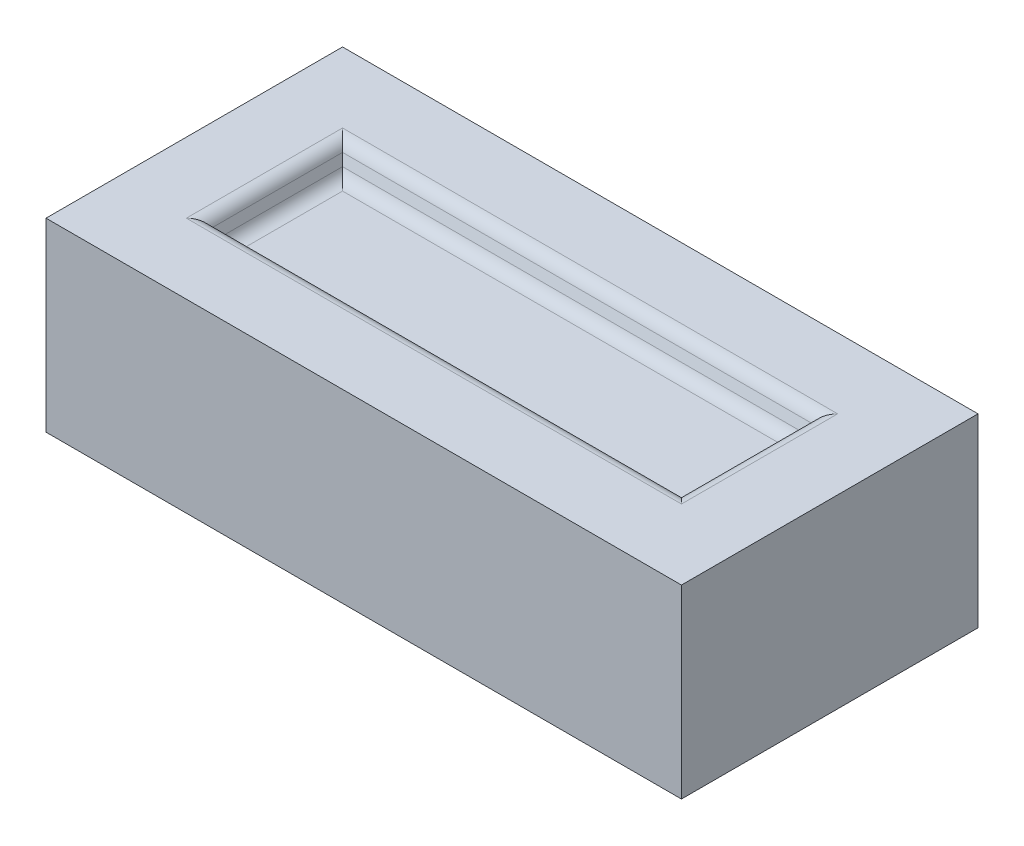
ISO-10303-21;
HEADER;
FILE_DESCRIPTION(('STEP AP214'),'2;1');
FILE_NAME('part.step','',(''),(''),'','','');
FILE_SCHEMA(('AUTOMOTIVE_DESIGN { 1 0 10303 214 1 1 1 1 }'));
ENDSEC;
DATA;
#1=APPLICATION_CONTEXT('core data for automotive mechanical design processes');
#2=APPLICATION_PROTOCOL_DEFINITION('international standard','automotive_design',2000,#1);
#3=PRODUCT_CONTEXT('',#1,'mechanical');
#4=PRODUCT('Part','Part','',(#3));
#5=PRODUCT_RELATED_PRODUCT_CATEGORY('part','',(#4));
#6=PRODUCT_DEFINITION_FORMATION('','',#4);
#7=PRODUCT_DEFINITION_CONTEXT('part definition',#1,'design');
#8=PRODUCT_DEFINITION('design','',#6,#7);
#9=PRODUCT_DEFINITION_SHAPE('','',#8);
#10=(LENGTH_UNIT() NAMED_UNIT(*) SI_UNIT(.MILLI.,.METRE.));
#11=(NAMED_UNIT(*) PLANE_ANGLE_UNIT() SI_UNIT($,.RADIAN.));
#12=(NAMED_UNIT(*) SI_UNIT($,.STERADIAN.) SOLID_ANGLE_UNIT());
#13=UNCERTAINTY_MEASURE_WITH_UNIT(LENGTH_MEASURE(1.E-05),#10,'distance_accuracy_value','');
#14=(GEOMETRIC_REPRESENTATION_CONTEXT(3) GLOBAL_UNCERTAINTY_ASSIGNED_CONTEXT((#13)) GLOBAL_UNIT_ASSIGNED_CONTEXT((#10,
#11,#12)) REPRESENTATION_CONTEXT('',''));
#15=CARTESIAN_POINT('',(0.,0.,0.));
#16=DIRECTION('',(0.,0.,1.));
#17=DIRECTION('',(1.,0.,0.));
#18=AXIS2_PLACEMENT_3D('',#15,#16,#17);
#19=CARTESIAN_POINT('',(0.,0.,0.));
#20=DIRECTION('',(0.,1.,0.));
#21=DIRECTION('',(0.,0.,1.));
#22=AXIS2_PLACEMENT_3D('',#19,#20,#21);
#23=PLANE('',#22);
#24=DIRECTION('',(1.,0.,0.));
#25=VECTOR('',#24,1.);
#26=CARTESIAN_POINT('',(-90.,0.,-29.5010376910485));
#27=LINE('',#26,#25);
#28=CARTESIAN_POINT('',(93.5010376910486,0.,-29.5010376910486));
#29=VERTEX_POINT('',#28);
#30=CARTESIAN_POINT('',(-93.5010376910486,0.,-29.5010376910485));
#31=VERTEX_POINT('',#30);
#32=EDGE_CURVE('E56',#29,#31,#27,.F.);
#33=ORIENTED_EDGE('',*,*,#32,.T.);
#34=DIRECTION('',(0.,0.,-1.));
#35=VECTOR('',#34,1.);
#36=CARTESIAN_POINT('',(-93.5010376910485,0.,26.));
#37=LINE('',#36,#35);
#38=CARTESIAN_POINT('',(-93.5010376910485,0.,29.5010376910486));
#39=VERTEX_POINT('',#38);
#40=EDGE_CURVE('E11',#31,#39,#37,.F.);
#41=ORIENTED_EDGE('',*,*,#40,.T.);
#42=DIRECTION('',(-1.,0.,0.));
#43=VECTOR('',#42,1.);
#44=CARTESIAN_POINT('',(90.,0.,29.5010376910485));
#45=LINE('',#44,#43);
#46=CARTESIAN_POINT('',(93.5010376910486,0.,29.5010376910485));
#47=VERTEX_POINT('',#46);
#48=EDGE_CURVE('E41',#39,#47,#45,.F.);
#49=ORIENTED_EDGE('',*,*,#48,.T.);
#50=DIRECTION('',(0.,0.,1.));
#51=VECTOR('',#50,1.);
#52=CARTESIAN_POINT('',(93.5010376910486,0.,-26.));
#53=LINE('',#52,#51);
#54=EDGE_CURVE('E266',#47,#29,#53,.F.);
#55=ORIENTED_EDGE('',*,*,#54,.T.);
#56=EDGE_LOOP('',(#33,#41,#49,#55));
#57=FACE_BOUND('',#56,.T.);
#58=DIRECTION('',(0.,0.,1.));
#59=VECTOR('',#58,1.);
#60=CARTESIAN_POINT('',(-120.,0.,-56.));
#61=LINE('',#60,#59);
#62=CARTESIAN_POINT('',(-120.,0.,-56.));
#63=VERTEX_POINT('',#62);
#64=CARTESIAN_POINT('',(-120.,0.,56.));
#65=VERTEX_POINT('',#64);
#66=EDGE_CURVE('E197',#63,#65,#61,.T.);
#67=ORIENTED_EDGE('',*,*,#66,.F.);
#68=DIRECTION('',(-1.,0.,0.));
#69=VECTOR('',#68,1.);
#70=CARTESIAN_POINT('',(-120.,0.,-56.));
#71=LINE('',#70,#69);
#72=CARTESIAN_POINT('',(120.,0.,-56.));
#73=VERTEX_POINT('',#72);
#74=EDGE_CURVE('E193',#73,#63,#71,.T.);
#75=ORIENTED_EDGE('',*,*,#74,.F.);
#76=DIRECTION('',(0.,0.,-1.));
#77=VECTOR('',#76,1.);
#78=CARTESIAN_POINT('',(120.,0.,-56.));
#79=LINE('',#78,#77);
#80=CARTESIAN_POINT('',(120.,0.,56.));
#81=VERTEX_POINT('',#80);
#82=EDGE_CURVE('E355',#81,#73,#79,.T.);
#83=ORIENTED_EDGE('',*,*,#82,.F.);
#84=DIRECTION('',(1.,0.,0.));
#85=VECTOR('',#84,1.);
#86=CARTESIAN_POINT('',(-120.,0.,56.));
#87=LINE('',#86,#85);
#88=EDGE_CURVE('E353',#65,#81,#87,.T.);
#89=ORIENTED_EDGE('',*,*,#88,.F.);
#90=EDGE_LOOP('',(#67,#75,#83,#89));
#91=FACE_BOUND('',#90,.T.);
#92=ADVANCED_FACE('F32',(#57,#91),#23,.F.);
#93=CARTESIAN_POINT('',(-120.,70.,-56.));
#94=DIRECTION('',(1.,0.,0.));
#95=DIRECTION('',(0.,0.,-1.));
#96=AXIS2_PLACEMENT_3D('',#93,#94,#95);
#97=PLANE('',#96);
#98=ORIENTED_EDGE('',*,*,#66,.T.);
#99=DIRECTION('',(0.,-1.,0.));
#100=VECTOR('',#99,1.);
#101=CARTESIAN_POINT('',(-120.,70.,56.));
#102=LINE('',#101,#100);
#103=CARTESIAN_POINT('',(-120.,70.,56.));
#104=VERTEX_POINT('',#103);
#105=EDGE_CURVE('E177',#104,#65,#102,.T.);
#106=ORIENTED_EDGE('',*,*,#105,.F.);
#107=DIRECTION('',(0.,0.,1.));
#108=VECTOR('',#107,1.);
#109=CARTESIAN_POINT('',(-120.,70.,-56.));
#110=LINE('',#109,#108);
#111=CARTESIAN_POINT('',(-120.,70.,-56.));
#112=VERTEX_POINT('',#111);
#113=EDGE_CURVE('E184',#112,#104,#110,.T.);
#114=ORIENTED_EDGE('',*,*,#113,.F.);
#115=DIRECTION('',(0.,-1.,0.));
#116=VECTOR('',#115,1.);
#117=CARTESIAN_POINT('',(-120.,70.,-56.));
#118=LINE('',#117,#116);
#119=EDGE_CURVE('E351',#112,#63,#118,.T.);
#120=ORIENTED_EDGE('',*,*,#119,.T.);
#121=EDGE_LOOP('',(#98,#106,#114,#120));
#122=FACE_BOUND('',#121,.T.);
#123=ADVANCED_FACE('F195',(#122),#97,.F.);
#124=CARTESIAN_POINT('',(-120.,70.,56.));
#125=DIRECTION('',(0.,0.,-1.));
#126=DIRECTION('',(-1.,0.,0.));
#127=AXIS2_PLACEMENT_3D('',#124,#125,#126);
#128=PLANE('',#127);
#129=ORIENTED_EDGE('',*,*,#88,.T.);
#130=DIRECTION('',(0.,-1.,0.));
#131=VECTOR('',#130,1.);
#132=CARTESIAN_POINT('',(120.,70.,56.));
#133=LINE('',#132,#131);
#134=CARTESIAN_POINT('',(120.,70.,56.));
#135=VERTEX_POINT('',#134);
#136=EDGE_CURVE('E180',#135,#81,#133,.T.);
#137=ORIENTED_EDGE('',*,*,#136,.F.);
#138=DIRECTION('',(1.,0.,0.));
#139=VECTOR('',#138,1.);
#140=CARTESIAN_POINT('',(-120.,70.,56.));
#141=LINE('',#140,#139);
#142=EDGE_CURVE('E173',#104,#135,#141,.T.);
#143=ORIENTED_EDGE('',*,*,#142,.F.);
#144=ORIENTED_EDGE('',*,*,#105,.T.);
#145=EDGE_LOOP('',(#129,#137,#143,#144));
#146=FACE_BOUND('',#145,.T.);
#147=ADVANCED_FACE('F175',(#146),#128,.F.);
#148=CARTESIAN_POINT('',(120.,70.,-56.));
#149=DIRECTION('',(-1.,0.,0.));
#150=DIRECTION('',(0.,0.,1.));
#151=AXIS2_PLACEMENT_3D('',#148,#149,#150);
#152=PLANE('',#151);
#153=ORIENTED_EDGE('',*,*,#82,.T.);
#154=DIRECTION('',(0.,-1.,0.));
#155=VECTOR('',#154,1.);
#156=CARTESIAN_POINT('',(120.,70.,-56.));
#157=LINE('',#156,#155);
#158=CARTESIAN_POINT('',(120.,70.,-56.));
#159=VERTEX_POINT('',#158);
#160=EDGE_CURVE('E202',#159,#73,#157,.T.);
#161=ORIENTED_EDGE('',*,*,#160,.F.);
#162=DIRECTION('',(0.,0.,-1.));
#163=VECTOR('',#162,1.);
#164=CARTESIAN_POINT('',(120.,70.,-56.));
#165=LINE('',#164,#163);
#166=EDGE_CURVE('E183',#135,#159,#165,.T.);
#167=ORIENTED_EDGE('',*,*,#166,.F.);
#168=ORIENTED_EDGE('',*,*,#136,.T.);
#169=EDGE_LOOP('',(#153,#161,#167,#168));
#170=FACE_BOUND('',#169,.T.);
#171=ADVANCED_FACE('F366',(#170),#152,.F.);
#172=CARTESIAN_POINT('',(-120.,70.,-56.));
#173=DIRECTION('',(0.,0.,1.));
#174=DIRECTION('',(1.,0.,0.));
#175=AXIS2_PLACEMENT_3D('',#172,#173,#174);
#176=PLANE('',#175);
#177=ORIENTED_EDGE('',*,*,#74,.T.);
#178=ORIENTED_EDGE('',*,*,#119,.F.);
#179=DIRECTION('',(-1.,0.,0.));
#180=VECTOR('',#179,1.);
#181=CARTESIAN_POINT('',(-120.,70.,-56.));
#182=LINE('',#181,#180);
#183=EDGE_CURVE('E189',#159,#112,#182,.T.);
#184=ORIENTED_EDGE('',*,*,#183,.F.);
#185=ORIENTED_EDGE('',*,*,#160,.T.);
#186=EDGE_LOOP('',(#177,#178,#184,#185));
#187=FACE_BOUND('',#186,.T.);
#188=ADVANCED_FACE('F362',(#187),#176,.F.);
#189=CARTESIAN_POINT('',(0.,70.,0.));
#190=DIRECTION('',(0.,1.,0.));
#191=DIRECTION('',(0.,0.,1.));
#192=AXIS2_PLACEMENT_3D('',#189,#190,#191);
#193=PLANE('',#192);
#194=DIRECTION('',(0.,0.,1.));
#195=VECTOR('',#194,1.);
#196=CARTESIAN_POINT('',(-93.5010376910486,70.,-26.));
#197=LINE('',#196,#195);
#198=CARTESIAN_POINT('',(-93.5010376910486,70.,29.5010376910486));
#199=VERTEX_POINT('',#198);
#200=CARTESIAN_POINT('',(-93.5010376910486,70.,-29.5010376910485));
#201=VERTEX_POINT('',#200);
#202=EDGE_CURVE('E257',#199,#201,#197,.F.);
#203=ORIENTED_EDGE('',*,*,#202,.T.);
#204=DIRECTION('',(-1.,0.,0.));
#205=VECTOR('',#204,1.);
#206=CARTESIAN_POINT('',(90.,70.,-29.5010376910486));
#207=LINE('',#206,#205);
#208=CARTESIAN_POINT('',(93.5010376910486,70.,-29.5010376910486));
#209=VERTEX_POINT('',#208);
#210=EDGE_CURVE('E263',#201,#209,#207,.F.);
#211=ORIENTED_EDGE('',*,*,#210,.T.);
#212=DIRECTION('',(0.,0.,-1.));
#213=VECTOR('',#212,1.);
#214=CARTESIAN_POINT('',(93.5010376910486,70.,26.));
#215=LINE('',#214,#213);
#216=CARTESIAN_POINT('',(93.5010376910486,70.,29.5010376910485));
#217=VERTEX_POINT('',#216);
#218=EDGE_CURVE('E261',#209,#217,#215,.F.);
#219=ORIENTED_EDGE('',*,*,#218,.T.);
#220=DIRECTION('',(1.,0.,0.));
#221=VECTOR('',#220,1.);
#222=CARTESIAN_POINT('',(-90.,70.,29.5010376910486));
#223=LINE('',#222,#221);
#224=EDGE_CURVE('E259',#217,#199,#223,.F.);
#225=ORIENTED_EDGE('',*,*,#224,.T.);
#226=EDGE_LOOP('',(#203,#211,#219,#225));
#227=FACE_BOUND('',#226,.T.);
#228=ORIENTED_EDGE('',*,*,#113,.T.);
#229=ORIENTED_EDGE('',*,*,#142,.T.);
#230=ORIENTED_EDGE('',*,*,#166,.T.);
#231=ORIENTED_EDGE('',*,*,#183,.T.);
#232=EDGE_LOOP('',(#228,#229,#230,#231));
#233=FACE_BOUND('',#232,.T.);
#234=ADVANCED_FACE('F187',(#227,#233),#193,.T.);
#235=CARTESIAN_POINT('',(90.,70.,-26.));
#236=DIRECTION('',(0.939692620785908,-0.342020143325669,0.));
#237=DIRECTION('',(0.342020143325669,0.939692620785909,0.));
#238=AXIS2_PLACEMENT_3D('',#235,#236,#237);
#239=PLANE('',#238);
#240=DIRECTION('',(0.323615577118185,0.889126490715988,-0.323615577118185));
#241=VECTOR('',#240,1.);
#242=CARTESIAN_POINT('',(90.,70.,-26.));
#243=LINE('',#242,#241);
#244=CARTESIAN_POINT('',(87.557723070219,63.2898992833717,-23.557723070219));
#245=VERTEX_POINT('',#244);
#246=CARTESIAN_POINT('',(88.802574587119,66.7101007166283,-24.802574587119));
#247=VERTEX_POINT('',#246);
#248=EDGE_CURVE('E341',#245,#247,#243,.T.);
#249=ORIENTED_EDGE('',*,*,#248,.F.);
#250=DIRECTION('',(0.,0.,-1.));
#251=VECTOR('',#250,1.);
#252=CARTESIAN_POINT('',(87.557723070219,63.2898992833717,-26.));
#253=LINE('',#252,#251);
#254=CARTESIAN_POINT('',(87.557723070219,63.2898992833717,23.557723070219));
#255=VERTEX_POINT('',#254);
#256=EDGE_CURVE('E255',#245,#255,#253,.F.);
#257=ORIENTED_EDGE('',*,*,#256,.T.);
#258=DIRECTION('',(0.323615577118185,0.889126490715988,0.323615577118185));
#259=VECTOR('',#258,1.);
#260=CARTESIAN_POINT('',(71.1491324843636,18.2076671636582,7.14913248436354));
#261=LINE('',#260,#259);
#262=CARTESIAN_POINT('',(88.8025745871191,66.7101007166284,24.802574587119));
#263=VERTEX_POINT('',#262);
#264=EDGE_CURVE('E337',#255,#263,#261,.T.);
#265=ORIENTED_EDGE('',*,*,#264,.T.);
#266=DIRECTION('',(0.,0.,-1.));
#267=VECTOR('',#266,1.);
#268=CARTESIAN_POINT('',(88.802574587119,66.7101007166283,-26.));
#269=LINE('',#268,#267);
#270=EDGE_CURVE('E253',#263,#247,#269,.T.);
#271=ORIENTED_EDGE('',*,*,#270,.T.);
#272=EDGE_LOOP('',(#249,#257,#265,#271));
#273=FACE_BOUND('',#272,.T.);
#274=ADVANCED_FACE('F384',(#273),#239,.F.);
#275=CARTESIAN_POINT('',(-90.,70.,26.));
#276=DIRECTION('',(0.,-0.342020143325669,0.939692620785908));
#277=DIRECTION('',(0.,-0.939692620785908,-0.342020143325669));
#278=AXIS2_PLACEMENT_3D('',#275,#276,#277);
#279=PLANE('',#278);
#280=ORIENTED_EDGE('',*,*,#264,.F.);
#281=DIRECTION('',(1.,0.,0.));
#282=VECTOR('',#281,1.);
#283=CARTESIAN_POINT('',(-90.,63.2898992833717,23.557723070219));
#284=LINE('',#283,#282);
#285=CARTESIAN_POINT('',(-87.557723070219,63.2898992833717,23.557723070219));
#286=VERTEX_POINT('',#285);
#287=EDGE_CURVE('E241',#255,#286,#284,.F.);
#288=ORIENTED_EDGE('',*,*,#287,.T.);
#289=DIRECTION('',(-0.323615577118185,0.889126490715988,0.323615577118185));
#290=VECTOR('',#289,1.);
#291=CARTESIAN_POINT('',(-84.5541938288161,55.0377705139457,20.5541938288162));
#292=LINE('',#291,#290);
#293=CARTESIAN_POINT('',(-88.802574587119,66.7101007166283,24.802574587119));
#294=VERTEX_POINT('',#293);
#295=EDGE_CURVE('E340',#286,#294,#292,.T.);
#296=ORIENTED_EDGE('',*,*,#295,.T.);
#297=DIRECTION('',(1.,0.,0.));
#298=VECTOR('',#297,1.);
#299=CARTESIAN_POINT('',(90.,66.7101007166283,24.802574587119));
#300=LINE('',#299,#298);
#301=EDGE_CURVE('E239',#294,#263,#300,.T.);
#302=ORIENTED_EDGE('',*,*,#301,.T.);
#303=EDGE_LOOP('',(#280,#288,#296,#302));
#304=FACE_BOUND('',#303,.T.);
#305=ADVANCED_FACE('F386',(#304),#279,.F.);
#306=CARTESIAN_POINT('',(-90.,70.,-26.));
#307=DIRECTION('',(-0.939692620785908,-0.342020143325669,0.));
#308=DIRECTION('',(0.342020143325669,-0.939692620785909,0.));
#309=AXIS2_PLACEMENT_3D('',#306,#307,#308);
#310=PLANE('',#309);
#311=ORIENTED_EDGE('',*,*,#295,.F.);
#312=DIRECTION('',(0.,0.,1.));
#313=VECTOR('',#312,1.);
#314=CARTESIAN_POINT('',(-87.557723070219,63.2898992833717,-26.));
#315=LINE('',#314,#313);
#316=CARTESIAN_POINT('',(-87.557723070219,63.2898992833717,-23.557723070219));
#317=VERTEX_POINT('',#316);
#318=EDGE_CURVE('E246',#286,#317,#315,.F.);
#319=ORIENTED_EDGE('',*,*,#318,.T.);
#320=DIRECTION('',(-0.323615577118185,0.889126490715988,-0.323615577118185));
#321=VECTOR('',#320,1.);
#322=CARTESIAN_POINT('',(-90.,70.,-26.));
#323=LINE('',#322,#321);
#324=CARTESIAN_POINT('',(-88.802574587119,66.7101007166283,-24.802574587119));
#325=VERTEX_POINT('',#324);
#326=EDGE_CURVE('E344',#317,#325,#323,.T.);
#327=ORIENTED_EDGE('',*,*,#326,.T.);
#328=DIRECTION('',(0.,0.,1.));
#329=VECTOR('',#328,1.);
#330=CARTESIAN_POINT('',(-88.802574587119,66.7101007166283,26.));
#331=LINE('',#330,#329);
#332=EDGE_CURVE('E244',#325,#294,#331,.T.);
#333=ORIENTED_EDGE('',*,*,#332,.T.);
#334=EDGE_LOOP('',(#311,#319,#327,#333));
#335=FACE_BOUND('',#334,.T.);
#336=ADVANCED_FACE('F389',(#335),#310,.F.);
#337=CARTESIAN_POINT('',(-90.,70.,-26.));
#338=DIRECTION('',(0.,-0.342020143325669,-0.939692620785908));
#339=DIRECTION('',(0.,0.939692620785909,-0.342020143325669));
#340=AXIS2_PLACEMENT_3D('',#337,#338,#339);
#341=PLANE('',#340);
#342=ORIENTED_EDGE('',*,*,#326,.F.);
#343=DIRECTION('',(-1.,0.,0.));
#344=VECTOR('',#343,1.);
#345=CARTESIAN_POINT('',(-90.,63.2898992833717,-23.557723070219));
#346=LINE('',#345,#344);
#347=EDGE_CURVE('E251',#317,#245,#346,.F.);
#348=ORIENTED_EDGE('',*,*,#347,.T.);
#349=ORIENTED_EDGE('',*,*,#248,.T.);
#350=DIRECTION('',(-1.,0.,0.));
#351=VECTOR('',#350,1.);
#352=CARTESIAN_POINT('',(-90.,66.7101007166283,-24.802574587119));
#353=LINE('',#352,#351);
#354=EDGE_CURVE('E248',#247,#325,#353,.T.);
#355=ORIENTED_EDGE('',*,*,#354,.T.);
#356=EDGE_LOOP('',(#342,#348,#349,#355));
#357=FACE_BOUND('',#356,.T.);
#358=ADVANCED_FACE('F393',(#357),#341,.F.);
#359=CARTESIAN_POINT('',(0.,60.,0.));
#360=DIRECTION('',(0.,1.,0.));
#361=DIRECTION('',(0.,0.,1.));
#362=AXIS2_PLACEMENT_3D('',#359,#360,#361);
#363=PLANE('',#362);
#364=DIRECTION('',(0.,0.,1.));
#365=VECTOR('',#364,1.);
#366=CARTESIAN_POINT('',(-82.8592599662894,60.,0.));
#367=LINE('',#366,#365);
#368=CARTESIAN_POINT('',(-82.8592599662895,60.,-18.8592599662894));
#369=VERTEX_POINT('',#368);
#370=CARTESIAN_POINT('',(-82.8592599662894,60.,18.8592599662894));
#371=VERTEX_POINT('',#370);
#372=EDGE_CURVE('E234',#369,#371,#367,.T.);
#373=ORIENTED_EDGE('',*,*,#372,.T.);
#374=DIRECTION('',(1.,0.,0.));
#375=VECTOR('',#374,1.);
#376=CARTESIAN_POINT('',(0.,60.,18.8592599662894));
#377=LINE('',#376,#375);
#378=CARTESIAN_POINT('',(82.8592599662895,60.,18.8592599662894));
#379=VERTEX_POINT('',#378);
#380=EDGE_CURVE('E236',#371,#379,#377,.T.);
#381=ORIENTED_EDGE('',*,*,#380,.T.);
#382=DIRECTION('',(0.,0.,-1.));
#383=VECTOR('',#382,1.);
#384=CARTESIAN_POINT('',(82.8592599662895,60.,0.));
#385=LINE('',#384,#383);
#386=CARTESIAN_POINT('',(82.8592599662895,60.,-18.8592599662895));
#387=VERTEX_POINT('',#386);
#388=EDGE_CURVE('E230',#379,#387,#385,.T.);
#389=ORIENTED_EDGE('',*,*,#388,.T.);
#390=DIRECTION('',(-1.,0.,0.));
#391=VECTOR('',#390,1.);
#392=CARTESIAN_POINT('',(0.,60.,-18.8592599662894));
#393=LINE('',#392,#391);
#394=EDGE_CURVE('E232',#387,#369,#393,.T.);
#395=ORIENTED_EDGE('',*,*,#394,.T.);
#396=EDGE_LOOP('',(#373,#381,#389,#395));
#397=FACE_BOUND('',#396,.T.);
#398=ADVANCED_FACE('F397',(#397),#363,.T.);
#399=CARTESIAN_POINT('',(90.,0.,-26.));
#400=DIRECTION('',(0.939692620785908,0.342020143325669,0.));
#401=DIRECTION('',(-0.342020143325669,0.939692620785909,0.));
#402=AXIS2_PLACEMENT_3D('',#399,#400,#401);
#403=PLANE('',#402);
#404=DIRECTION('',(0.323615577118185,-0.889126490715988,0.323615577118185));
#405=VECTOR('',#404,1.);
#406=CARTESIAN_POINT('',(84.5541938288162,14.9622294860543,20.5541938288161));
#407=LINE('',#406,#405);
#408=CARTESIAN_POINT('',(87.557723070219,6.71010071662835,23.557723070219));
#409=VERTEX_POINT('',#408);
#410=CARTESIAN_POINT('',(88.802574587119,3.28989928337166,24.802574587119));
#411=VERTEX_POINT('',#410);
#412=EDGE_CURVE('E281',#409,#411,#407,.T.);
#413=ORIENTED_EDGE('',*,*,#412,.F.);
#414=DIRECTION('',(0.,0.,-1.));
#415=VECTOR('',#414,1.);
#416=CARTESIAN_POINT('',(87.557723070219,6.71010071662835,-22.360297657338));
#417=LINE('',#416,#415);
#418=CARTESIAN_POINT('',(87.557723070219,6.71010071662836,-23.557723070219));
#419=VERTEX_POINT('',#418);
#420=EDGE_CURVE('E228',#409,#419,#417,.T.);
#421=ORIENTED_EDGE('',*,*,#420,.T.);
#422=DIRECTION('',(0.323615577118185,-0.889126490715988,-0.323615577118185));
#423=VECTOR('',#422,1.);
#424=CARTESIAN_POINT('',(71.1491324843636,51.7923328363418,-7.14913248436358));
#425=LINE('',#424,#423);
#426=CARTESIAN_POINT('',(88.802574587119,3.28989928337168,-24.802574587119));
#427=VERTEX_POINT('',#426);
#428=EDGE_CURVE('E323',#419,#427,#425,.T.);
#429=ORIENTED_EDGE('',*,*,#428,.T.);
#430=DIRECTION('',(0.,0.,-1.));
#431=VECTOR('',#430,1.);
#432=CARTESIAN_POINT('',(88.802574587119,3.28989928337166,26.));
#433=LINE('',#432,#431);
#434=EDGE_CURVE('E226',#427,#411,#433,.F.);
#435=ORIENTED_EDGE('',*,*,#434,.T.);
#436=EDGE_LOOP('',(#413,#421,#429,#435));
#437=FACE_BOUND('',#436,.T.);
#438=ADVANCED_FACE('F320',(#437),#403,.F.);
#439=CARTESIAN_POINT('',(-90.,0.,-26.));
#440=DIRECTION('',(0.,0.342020143325669,-0.939692620785908));
#441=DIRECTION('',(0.,0.939692620785909,0.342020143325669));
#442=AXIS2_PLACEMENT_3D('',#439,#440,#441);
#443=PLANE('',#442);
#444=ORIENTED_EDGE('',*,*,#428,.F.);
#445=DIRECTION('',(-1.,0.,0.));
#446=VECTOR('',#445,1.);
#447=CARTESIAN_POINT('',(-86.360297657338,6.71010071662834,-23.557723070219));
#448=LINE('',#447,#446);
#449=CARTESIAN_POINT('',(-87.557723070219,6.71010071662835,-23.557723070219));
#450=VERTEX_POINT('',#449);
#451=EDGE_CURVE('E200',#419,#450,#448,.T.);
#452=ORIENTED_EDGE('',*,*,#451,.T.);
#453=DIRECTION('',(-0.323615577118185,-0.889126490715988,-0.323615577118185));
#454=VECTOR('',#453,1.);
#455=CARTESIAN_POINT('',(-90.,0.,-26.));
#456=LINE('',#455,#454);
#457=CARTESIAN_POINT('',(-88.802574587119,3.28989928337166,-24.802574587119));
#458=VERTEX_POINT('',#457);
#459=EDGE_CURVE('E331',#450,#458,#456,.T.);
#460=ORIENTED_EDGE('',*,*,#459,.T.);
#461=DIRECTION('',(-1.,0.,0.));
#462=VECTOR('',#461,1.);
#463=CARTESIAN_POINT('',(90.,3.28989928337166,-24.802574587119));
#464=LINE('',#463,#462);
#465=EDGE_CURVE('E198',#458,#427,#464,.F.);
#466=ORIENTED_EDGE('',*,*,#465,.T.);
#467=EDGE_LOOP('',(#444,#452,#460,#466));
#468=FACE_BOUND('',#467,.T.);
#469=ADVANCED_FACE('F405',(#468),#443,.F.);
#470=CARTESIAN_POINT('',(-90.,0.,-26.));
#471=DIRECTION('',(-0.939692620785908,0.342020143325669,0.));
#472=DIRECTION('',(-0.342020143325669,-0.939692620785909,0.));
#473=AXIS2_PLACEMENT_3D('',#470,#471,#472);
#474=PLANE('',#473);
#475=ORIENTED_EDGE('',*,*,#459,.F.);
#476=DIRECTION('',(0.,0.,1.));
#477=VECTOR('',#476,1.);
#478=CARTESIAN_POINT('',(-87.557723070219,6.71010071662835,22.360297657338));
#479=LINE('',#478,#477);
#480=CARTESIAN_POINT('',(-87.557723070219,6.71010071662835,23.557723070219));
#481=VERTEX_POINT('',#480);
#482=EDGE_CURVE('E220',#450,#481,#479,.T.);
#483=ORIENTED_EDGE('',*,*,#482,.T.);
#484=DIRECTION('',(-0.323615577118185,-0.889126490715988,0.323615577118185));
#485=VECTOR('',#484,1.);
#486=CARTESIAN_POINT('',(-90.,0.,26.));
#487=LINE('',#486,#485);
#488=CARTESIAN_POINT('',(-88.802574587119,3.28989928337166,24.802574587119));
#489=VERTEX_POINT('',#488);
#490=EDGE_CURVE('E329',#481,#489,#487,.T.);
#491=ORIENTED_EDGE('',*,*,#490,.T.);
#492=DIRECTION('',(0.,0.,1.));
#493=VECTOR('',#492,1.);
#494=CARTESIAN_POINT('',(-88.802574587119,3.28989928337166,-26.));
#495=LINE('',#494,#493);
#496=EDGE_CURVE('E217',#489,#458,#495,.F.);
#497=ORIENTED_EDGE('',*,*,#496,.T.);
#498=EDGE_LOOP('',(#475,#483,#491,#497));
#499=FACE_BOUND('',#498,.T.);
#500=ADVANCED_FACE('F408',(#499),#474,.F.);
#501=CARTESIAN_POINT('',(-90.,0.,26.));
#502=DIRECTION('',(0.,0.342020143325669,0.939692620785908));
#503=DIRECTION('',(0.,-0.939692620785908,0.342020143325669));
#504=AXIS2_PLACEMENT_3D('',#501,#502,#503);
#505=PLANE('',#504);
#506=ORIENTED_EDGE('',*,*,#490,.F.);
#507=DIRECTION('',(1.,0.,0.));
#508=VECTOR('',#507,1.);
#509=CARTESIAN_POINT('',(86.3602976573379,6.71010071662835,23.557723070219));
#510=LINE('',#509,#508);
#511=EDGE_CURVE('E224',#481,#409,#510,.T.);
#512=ORIENTED_EDGE('',*,*,#511,.T.);
#513=ORIENTED_EDGE('',*,*,#412,.T.);
#514=DIRECTION('',(1.,0.,0.));
#515=VECTOR('',#514,1.);
#516=CARTESIAN_POINT('',(-90.,3.28989928337166,24.802574587119));
#517=LINE('',#516,#515);
#518=EDGE_CURVE('E222',#411,#489,#517,.F.);
#519=ORIENTED_EDGE('',*,*,#518,.T.);
#520=EDGE_LOOP('',(#506,#512,#513,#519));
#521=FACE_BOUND('',#520,.T.);
#522=ADVANCED_FACE('F326',(#521),#505,.F.);
#523=CARTESIAN_POINT('',(0.,10.,0.));
#524=DIRECTION('',(0.,-1.,0.));
#525=DIRECTION('',(0.,0.,1.));
#526=AXIS2_PLACEMENT_3D('',#523,#524,#525);
#527=PLANE('',#526);
#528=DIRECTION('',(0.,0.,-1.));
#529=VECTOR('',#528,1.);
#530=CARTESIAN_POINT('',(-82.8592599662894,10.,-22.360297657338));
#531=LINE('',#530,#529);
#532=CARTESIAN_POINT('',(-82.8592599662894,10.,18.8592599662895));
#533=VERTEX_POINT('',#532);
#534=CARTESIAN_POINT('',(-82.8592599662894,10.,-18.8592599662894));
#535=VERTEX_POINT('',#534);
#536=EDGE_CURVE('E212',#533,#535,#531,.T.);
#537=ORIENTED_EDGE('',*,*,#536,.T.);
#538=DIRECTION('',(1.,0.,0.));
#539=VECTOR('',#538,1.);
#540=CARTESIAN_POINT('',(86.360297657338,10.,-18.8592599662895));
#541=LINE('',#540,#539);
#542=CARTESIAN_POINT('',(82.8592599662894,10.,-18.8592599662895));
#543=VERTEX_POINT('',#542);
#544=EDGE_CURVE('E214',#535,#543,#541,.T.);
#545=ORIENTED_EDGE('',*,*,#544,.T.);
#546=DIRECTION('',(0.,0.,1.));
#547=VECTOR('',#546,1.);
#548=CARTESIAN_POINT('',(82.8592599662894,10.,22.360297657338));
#549=LINE('',#548,#547);
#550=CARTESIAN_POINT('',(82.8592599662894,10.,18.8592599662894));
#551=VERTEX_POINT('',#550);
#552=EDGE_CURVE('E208',#543,#551,#549,.T.);
#553=ORIENTED_EDGE('',*,*,#552,.T.);
#554=DIRECTION('',(-1.,0.,0.));
#555=VECTOR('',#554,1.);
#556=CARTESIAN_POINT('',(-86.360297657338,10.,18.8592599662895));
#557=LINE('',#556,#555);
#558=EDGE_CURVE('E210',#551,#533,#557,.T.);
#559=ORIENTED_EDGE('',*,*,#558,.T.);
#560=EDGE_LOOP('',(#537,#545,#553,#559));
#561=FACE_BOUND('',#560,.T.);
#562=ADVANCED_FACE('F415',(#561),#527,.T.);
#563=CARTESIAN_POINT('',(-90.,5.,18.8592599662895));
#564=DIRECTION('',(1.,0.,0.));
#565=DIRECTION('',(0.,0.,-1.));
#566=AXIS2_PLACEMENT_3D('',#563,#564,#565);
#567=CYLINDRICAL_SURFACE('',#566,5.);
#568=CARTESIAN_POINT('',(-82.8592599662894,5.,18.8592599662895));
#569=DIRECTION('',(0.707106781186548,0.,0.707106781186547));
#570=DIRECTION('',(-0.707106781186547,0.,0.707106781186548));
#571=AXIS2_PLACEMENT_3D('',#568,#569,#570);
#572=ELLIPSE('',#571,7.07106781186547,5.);
#573=EDGE_CURVE('E275',#533,#481,#572,.T.);
#574=ORIENTED_EDGE('',*,*,#573,.F.);
#575=ORIENTED_EDGE('',*,*,#558,.F.);
#576=CARTESIAN_POINT('',(82.8592599662894,5.,18.8592599662894));
#577=DIRECTION('',(0.707106781186547,0.,-0.707106781186548));
#578=DIRECTION('',(0.707106781186547,0.,0.707106781186547));
#579=AXIS2_PLACEMENT_3D('',#576,#577,#578);
#580=ELLIPSE('',#579,7.07106781186547,5.);
#581=EDGE_CURVE('E278',#409,#551,#580,.F.);
#582=ORIENTED_EDGE('',*,*,#581,.F.);
#583=ORIENTED_EDGE('',*,*,#511,.F.);
#584=EDGE_LOOP('',(#574,#575,#582,#583));
#585=FACE_BOUND('',#584,.T.);
#586=ADVANCED_FACE('F419',(#585),#567,.F.);
#587=CARTESIAN_POINT('',(82.8592599662894,5.,-26.));
#588=DIRECTION('',(0.,0.,-1.));
#589=DIRECTION('',(-1.,0.,0.));
#590=AXIS2_PLACEMENT_3D('',#587,#588,#589);
#591=CYLINDRICAL_SURFACE('',#590,5.);
#592=ORIENTED_EDGE('',*,*,#581,.T.);
#593=ORIENTED_EDGE('',*,*,#552,.F.);
#594=CARTESIAN_POINT('',(82.8592599662895,5.,-18.8592599662895));
#595=DIRECTION('',(-0.707106781186548,0.,-0.707106781186547));
#596=DIRECTION('',(-0.707106781186547,0.,0.707106781186548));
#597=AXIS2_PLACEMENT_3D('',#594,#595,#596);
#598=ELLIPSE('',#597,7.07106781186548,5.);
#599=EDGE_CURVE('E272',#419,#543,#598,.F.);
#600=ORIENTED_EDGE('',*,*,#599,.F.);
#601=ORIENTED_EDGE('',*,*,#420,.F.);
#602=EDGE_LOOP('',(#592,#593,#600,#601));
#603=FACE_BOUND('',#602,.T.);
#604=ADVANCED_FACE('F424',(#603),#591,.F.);
#605=CARTESIAN_POINT('',(-82.8592599662894,5.,-26.));
#606=DIRECTION('',(0.,0.,1.));
#607=DIRECTION('',(1.,0.,0.));
#608=AXIS2_PLACEMENT_3D('',#605,#606,#607);
#609=CYLINDRICAL_SURFACE('',#608,5.);
#610=ORIENTED_EDGE('',*,*,#573,.T.);
#611=ORIENTED_EDGE('',*,*,#482,.F.);
#612=CARTESIAN_POINT('',(-82.8592599662894,5.,-18.8592599662894));
#613=DIRECTION('',(-0.707106781186547,0.,0.707106781186548));
#614=DIRECTION('',(-0.707106781186548,0.,-0.707106781186547));
#615=AXIS2_PLACEMENT_3D('',#612,#613,#614);
#616=ELLIPSE('',#615,7.07106781186548,5.);
#617=EDGE_CURVE('E270',#535,#450,#616,.T.);
#618=ORIENTED_EDGE('',*,*,#617,.F.);
#619=ORIENTED_EDGE('',*,*,#536,.F.);
#620=EDGE_LOOP('',(#610,#611,#618,#619));
#621=FACE_BOUND('',#620,.T.);
#622=ADVANCED_FACE('F439',(#621),#609,.F.);
#623=CARTESIAN_POINT('',(-90.,5.,-18.8592599662894));
#624=DIRECTION('',(-1.,0.,0.));
#625=DIRECTION('',(0.,0.,1.));
#626=AXIS2_PLACEMENT_3D('',#623,#624,#625);
#627=CYLINDRICAL_SURFACE('',#626,5.);
#628=ORIENTED_EDGE('',*,*,#599,.T.);
#629=ORIENTED_EDGE('',*,*,#544,.F.);
#630=ORIENTED_EDGE('',*,*,#617,.T.);
#631=ORIENTED_EDGE('',*,*,#451,.F.);
#632=EDGE_LOOP('',(#628,#629,#630,#631));
#633=FACE_BOUND('',#632,.T.);
#634=ADVANCED_FACE('F434',(#633),#627,.F.);
#635=CARTESIAN_POINT('',(0.,65.,-18.8592599662894));
#636=DIRECTION('',(-1.,0.,0.));
#637=DIRECTION('',(0.,0.,1.));
#638=AXIS2_PLACEMENT_3D('',#635,#636,#637);
#639=CYLINDRICAL_SURFACE('',#638,5.);
#640=CARTESIAN_POINT('',(82.8592599662895,65.,-18.8592599662895));
#641=DIRECTION('',(-0.707106781186548,0.,-0.707106781186547));
#642=DIRECTION('',(-0.707106781186547,0.,0.707106781186548));
#643=AXIS2_PLACEMENT_3D('',#640,#641,#642);
#644=ELLIPSE('',#643,7.07106781186548,5.);
#645=EDGE_CURVE('E287',#245,#387,#644,.T.);
#646=ORIENTED_EDGE('',*,*,#645,.F.);
#647=ORIENTED_EDGE('',*,*,#347,.F.);
#648=CARTESIAN_POINT('',(-82.8592599662895,65.,-18.8592599662894));
#649=DIRECTION('',(-0.707106781186547,0.,0.707106781186548));
#650=DIRECTION('',(0.707106781186548,0.,0.707106781186547));
#651=AXIS2_PLACEMENT_3D('',#648,#649,#650);
#652=ELLIPSE('',#651,7.07106781186548,5.);
#653=EDGE_CURVE('E273',#369,#317,#652,.F.);
#654=ORIENTED_EDGE('',*,*,#653,.F.);
#655=ORIENTED_EDGE('',*,*,#394,.F.);
#656=EDGE_LOOP('',(#646,#647,#654,#655));
#657=FACE_BOUND('',#656,.T.);
#658=ADVANCED_FACE('F468',(#657),#639,.F.);
#659=CARTESIAN_POINT('',(-82.8592599662894,65.,0.));
#660=DIRECTION('',(0.,0.,1.));
#661=DIRECTION('',(1.,0.,0.));
#662=AXIS2_PLACEMENT_3D('',#659,#660,#661);
#663=CYLINDRICAL_SURFACE('',#662,5.);
#664=ORIENTED_EDGE('',*,*,#653,.T.);
#665=ORIENTED_EDGE('',*,*,#318,.F.);
#666=CARTESIAN_POINT('',(-82.8592599662894,65.,18.8592599662895));
#667=DIRECTION('',(0.707106781186548,0.,0.707106781186547));
#668=DIRECTION('',(0.707106781186547,0.,-0.707106781186548));
#669=AXIS2_PLACEMENT_3D('',#666,#667,#668);
#670=ELLIPSE('',#669,7.07106781186547,5.);
#671=EDGE_CURVE('E284',#371,#286,#670,.F.);
#672=ORIENTED_EDGE('',*,*,#671,.F.);
#673=ORIENTED_EDGE('',*,*,#372,.F.);
#674=EDGE_LOOP('',(#664,#665,#672,#673));
#675=FACE_BOUND('',#674,.T.);
#676=ADVANCED_FACE('F471',(#675),#663,.F.);
#677=CARTESIAN_POINT('',(82.8592599662895,65.,0.));
#678=DIRECTION('',(0.,0.,-1.));
#679=DIRECTION('',(-1.,0.,0.));
#680=AXIS2_PLACEMENT_3D('',#677,#678,#679);
#681=CYLINDRICAL_SURFACE('',#680,5.);
#682=ORIENTED_EDGE('',*,*,#645,.T.);
#683=ORIENTED_EDGE('',*,*,#388,.F.);
#684=CARTESIAN_POINT('',(82.8592599662895,65.,18.8592599662894));
#685=DIRECTION('',(0.707106781186547,0.,-0.707106781186548));
#686=DIRECTION('',(0.707106781186547,0.,0.707106781186547));
#687=AXIS2_PLACEMENT_3D('',#684,#685,#686);
#688=ELLIPSE('',#687,7.07106781186547,5.);
#689=EDGE_CURVE('E282',#255,#379,#688,.T.);
#690=ORIENTED_EDGE('',*,*,#689,.F.);
#691=ORIENTED_EDGE('',*,*,#256,.F.);
#692=EDGE_LOOP('',(#682,#683,#690,#691));
#693=FACE_BOUND('',#692,.T.);
#694=ADVANCED_FACE('F475',(#693),#681,.F.);
#695=CARTESIAN_POINT('',(0.,65.,18.8592599662894));
#696=DIRECTION('',(1.,0.,0.));
#697=DIRECTION('',(0.,0.,-1.));
#698=AXIS2_PLACEMENT_3D('',#695,#696,#697);
#699=CYLINDRICAL_SURFACE('',#698,5.);
#700=ORIENTED_EDGE('',*,*,#671,.T.);
#701=ORIENTED_EDGE('',*,*,#287,.F.);
#702=ORIENTED_EDGE('',*,*,#689,.T.);
#703=ORIENTED_EDGE('',*,*,#380,.F.);
#704=EDGE_LOOP('',(#700,#701,#702,#703));
#705=FACE_BOUND('',#704,.T.);
#706=ADVANCED_FACE('F455',(#705),#699,.F.);
#707=CARTESIAN_POINT('',(-90.,65.,29.5010376910486));
#708=DIRECTION('',(-1.,0.,0.));
#709=DIRECTION('',(0.,0.,1.));
#710=AXIS2_PLACEMENT_3D('',#707,#708,#709);
#711=CYLINDRICAL_SURFACE('',#710,5.);
#712=CARTESIAN_POINT('',(-93.5010376910486,65.,29.5010376910486));
#713=DIRECTION('',(-0.707106781186548,0.,-0.707106781186547));
#714=DIRECTION('',(-0.707106781186547,0.,0.707106781186548));
#715=AXIS2_PLACEMENT_3D('',#712,#713,#714);
#716=ELLIPSE('',#715,7.07106781186547,5.);
#717=EDGE_CURVE('E296',#199,#294,#716,.T.);
#718=ORIENTED_EDGE('',*,*,#717,.F.);
#719=ORIENTED_EDGE('',*,*,#224,.F.);
#720=CARTESIAN_POINT('',(93.5010376910486,65.,29.5010376910485));
#721=DIRECTION('',(-0.707106781186547,0.,0.707106781186548));
#722=DIRECTION('',(0.707106781186547,0.,0.707106781186547));
#723=AXIS2_PLACEMENT_3D('',#720,#721,#722);
#724=ELLIPSE('',#723,7.07106781186547,5.);
#725=EDGE_CURVE('E285',#263,#217,#724,.F.);
#726=ORIENTED_EDGE('',*,*,#725,.F.);
#727=ORIENTED_EDGE('',*,*,#301,.F.);
#728=EDGE_LOOP('',(#718,#719,#726,#727));
#729=FACE_BOUND('',#728,.T.);
#730=ADVANCED_FACE('F451',(#729),#711,.T.);
#731=CARTESIAN_POINT('',(93.5010376910486,65.,-26.));
#732=DIRECTION('',(0.,0.,1.));
#733=DIRECTION('',(1.,0.,0.));
#734=AXIS2_PLACEMENT_3D('',#731,#732,#733);
#735=CYLINDRICAL_SURFACE('',#734,5.);
#736=ORIENTED_EDGE('',*,*,#725,.T.);
#737=ORIENTED_EDGE('',*,*,#218,.F.);
#738=CARTESIAN_POINT('',(93.5010376910486,65.,-29.5010376910486));
#739=DIRECTION('',(0.707106781186548,0.,0.707106781186547));
#740=DIRECTION('',(0.707106781186547,0.,-0.707106781186548));
#741=AXIS2_PLACEMENT_3D('',#738,#739,#740);
#742=ELLIPSE('',#741,7.07106781186548,5.);
#743=EDGE_CURVE('E294',#247,#209,#742,.F.);
#744=ORIENTED_EDGE('',*,*,#743,.F.);
#745=ORIENTED_EDGE('',*,*,#270,.F.);
#746=EDGE_LOOP('',(#736,#737,#744,#745));
#747=FACE_BOUND('',#746,.T.);
#748=ADVANCED_FACE('F454',(#747),#735,.T.);
#749=CARTESIAN_POINT('',(-93.5010376910486,65.,-26.));
#750=DIRECTION('',(0.,0.,-1.));
#751=DIRECTION('',(-1.,0.,0.));
#752=AXIS2_PLACEMENT_3D('',#749,#750,#751);
#753=CYLINDRICAL_SURFACE('',#752,5.);
#754=ORIENTED_EDGE('',*,*,#717,.T.);
#755=ORIENTED_EDGE('',*,*,#332,.F.);
#756=CARTESIAN_POINT('',(-93.5010376910486,65.,-29.5010376910485));
#757=DIRECTION('',(0.707106781186547,0.,-0.707106781186548));
#758=DIRECTION('',(0.707106781186548,0.,0.707106781186547));
#759=AXIS2_PLACEMENT_3D('',#756,#757,#758);
#760=ELLIPSE('',#759,7.07106781186548,5.);
#761=EDGE_CURVE('E292',#201,#325,#760,.T.);
#762=ORIENTED_EDGE('',*,*,#761,.F.);
#763=ORIENTED_EDGE('',*,*,#202,.F.);
#764=EDGE_LOOP('',(#754,#755,#762,#763));
#765=FACE_BOUND('',#764,.T.);
#766=ADVANCED_FACE('F459',(#765),#753,.T.);
#767=CARTESIAN_POINT('',(-90.,65.,-29.5010376910485));
#768=DIRECTION('',(1.,0.,0.));
#769=DIRECTION('',(0.,0.,-1.));
#770=AXIS2_PLACEMENT_3D('',#767,#768,#769);
#771=CYLINDRICAL_SURFACE('',#770,5.);
#772=ORIENTED_EDGE('',*,*,#743,.T.);
#773=ORIENTED_EDGE('',*,*,#210,.F.);
#774=ORIENTED_EDGE('',*,*,#761,.T.);
#775=ORIENTED_EDGE('',*,*,#354,.F.);
#776=EDGE_LOOP('',(#772,#773,#774,#775));
#777=FACE_BOUND('',#776,.T.);
#778=ADVANCED_FACE('F463',(#777),#771,.T.);
#779=CARTESIAN_POINT('',(93.5010376910486,5.,0.));
#780=DIRECTION('',(0.,0.,-1.));
#781=DIRECTION('',(-1.,0.,0.));
#782=AXIS2_PLACEMENT_3D('',#779,#780,#781);
#783=CYLINDRICAL_SURFACE('',#782,5.);
#784=CARTESIAN_POINT('',(93.5010376910486,5.,29.5010376910485));
#785=DIRECTION('',(0.707106781186547,0.,-0.707106781186548));
#786=DIRECTION('',(0.707106781186547,0.,0.707106781186547));
#787=AXIS2_PLACEMENT_3D('',#784,#785,#786);
#788=ELLIPSE('',#787,7.07106781186547,5.);
#789=EDGE_CURVE('E303',#411,#47,#788,.F.);
#790=ORIENTED_EDGE('',*,*,#789,.F.);
#791=ORIENTED_EDGE('',*,*,#434,.F.);
#792=CARTESIAN_POINT('',(93.5010376910486,5.,-29.5010376910486));
#793=DIRECTION('',(-0.707106781186548,0.,-0.707106781186547));
#794=DIRECTION('',(-0.707106781186547,0.,0.707106781186548));
#795=AXIS2_PLACEMENT_3D('',#792,#793,#794);
#796=ELLIPSE('',#795,7.07106781186548,5.);
#797=EDGE_CURVE('E36',#29,#427,#796,.T.);
#798=ORIENTED_EDGE('',*,*,#797,.F.);
#799=ORIENTED_EDGE('',*,*,#54,.F.);
#800=EDGE_LOOP('',(#790,#791,#798,#799));
#801=FACE_BOUND('',#800,.T.);
#802=ADVANCED_FACE('F34',(#801),#783,.T.);
#803=CARTESIAN_POINT('',(0.,5.,-29.5010376910486));
#804=DIRECTION('',(-1.,0.,0.));
#805=DIRECTION('',(0.,0.,1.));
#806=AXIS2_PLACEMENT_3D('',#803,#804,#805);
#807=CYLINDRICAL_SURFACE('',#806,5.);
#808=ORIENTED_EDGE('',*,*,#797,.T.);
#809=ORIENTED_EDGE('',*,*,#465,.F.);
#810=CARTESIAN_POINT('',(-93.5010376910486,5.,-29.5010376910485));
#811=DIRECTION('',(-0.707106781186547,0.,0.707106781186548));
#812=DIRECTION('',(0.707106781186548,0.,0.707106781186547));
#813=AXIS2_PLACEMENT_3D('',#810,#811,#812);
#814=ELLIPSE('',#813,7.07106781186548,5.);
#815=EDGE_CURVE('E302',#31,#458,#814,.T.);
#816=ORIENTED_EDGE('',*,*,#815,.F.);
#817=ORIENTED_EDGE('',*,*,#32,.F.);
#818=EDGE_LOOP('',(#808,#809,#816,#817));
#819=FACE_BOUND('',#818,.T.);
#820=ADVANCED_FACE('F312',(#819),#807,.T.);
#821=CARTESIAN_POINT('',(0.,5.,29.5010376910486));
#822=DIRECTION('',(1.,0.,0.));
#823=DIRECTION('',(0.,0.,-1.));
#824=AXIS2_PLACEMENT_3D('',#821,#822,#823);
#825=CYLINDRICAL_SURFACE('',#824,5.);
#826=ORIENTED_EDGE('',*,*,#789,.T.);
#827=ORIENTED_EDGE('',*,*,#48,.F.);
#828=CARTESIAN_POINT('',(-93.5010376910485,5.,29.5010376910486));
#829=DIRECTION('',(0.707106781186548,0.,0.707106781186547));
#830=DIRECTION('',(-0.707106781186547,0.,0.707106781186548));
#831=AXIS2_PLACEMENT_3D('',#828,#829,#830);
#832=ELLIPSE('',#831,7.07106781186547,5.);
#833=EDGE_CURVE('E49',#489,#39,#832,.F.);
#834=ORIENTED_EDGE('',*,*,#833,.F.);
#835=ORIENTED_EDGE('',*,*,#518,.F.);
#836=EDGE_LOOP('',(#826,#827,#834,#835));
#837=FACE_BOUND('',#836,.T.);
#838=ADVANCED_FACE('F442',(#837),#825,.T.);
#839=CARTESIAN_POINT('',(-93.5010376910486,5.,0.));
#840=DIRECTION('',(0.,0.,1.));
#841=DIRECTION('',(1.,0.,0.));
#842=AXIS2_PLACEMENT_3D('',#839,#840,#841);
#843=CYLINDRICAL_SURFACE('',#842,5.);
#844=ORIENTED_EDGE('',*,*,#815,.T.);
#845=ORIENTED_EDGE('',*,*,#496,.F.);
#846=ORIENTED_EDGE('',*,*,#833,.T.);
#847=ORIENTED_EDGE('',*,*,#40,.F.);
#848=EDGE_LOOP('',(#844,#845,#846,#847));
#849=FACE_BOUND('',#848,.T.);
#850=ADVANCED_FACE('F441',(#849),#843,.T.);
#851=CLOSED_SHELL('',(#92,#123,#147,#171,#188,#234,#274,#305,#336,#358,#398,#438,#469,#500,#522,
#562,#586,#604,#622,#634,#658,#676,#694,#706,#730,#748,#766,#778,#802,#820,#838,#850));
#852=MANIFOLD_SOLID_BREP('B2',#851);
#853=ADVANCED_BREP_SHAPE_REPRESENTATION('',(#18,#852),#14);
#854=SHAPE_DEFINITION_REPRESENTATION(#9,#853);
ENDSEC;
END-ISO-10303-21;
